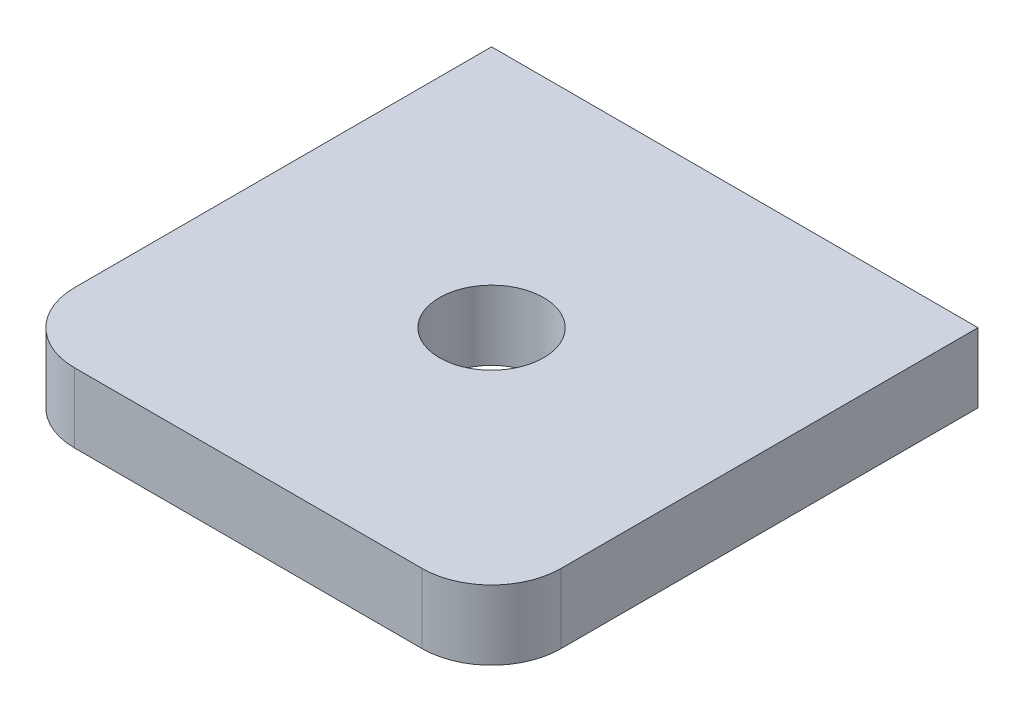
ISO-10303-21;
HEADER;
FILE_DESCRIPTION(('STEP AP214'),'2;1');
FILE_NAME('part.step','',(''),(''),'','','');
FILE_SCHEMA(('AUTOMOTIVE_DESIGN { 1 0 10303 214 1 1 1 1 }'));
ENDSEC;
DATA;
#1=APPLICATION_CONTEXT('core data for automotive mechanical design processes');
#2=APPLICATION_PROTOCOL_DEFINITION('international standard','automotive_design',2000,#1);
#3=PRODUCT_CONTEXT('',#1,'mechanical');
#4=PRODUCT('Part','Part','',(#3));
#5=PRODUCT_RELATED_PRODUCT_CATEGORY('part','',(#4));
#6=PRODUCT_DEFINITION_FORMATION('','',#4);
#7=PRODUCT_DEFINITION_CONTEXT('part definition',#1,'design');
#8=PRODUCT_DEFINITION('design','',#6,#7);
#9=PRODUCT_DEFINITION_SHAPE('','',#8);
#10=(LENGTH_UNIT() NAMED_UNIT(*) SI_UNIT(.MILLI.,.METRE.));
#11=(NAMED_UNIT(*) PLANE_ANGLE_UNIT() SI_UNIT($,.RADIAN.));
#12=(NAMED_UNIT(*) SI_UNIT($,.STERADIAN.) SOLID_ANGLE_UNIT());
#13=UNCERTAINTY_MEASURE_WITH_UNIT(LENGTH_MEASURE(1.E-05),#10,'distance_accuracy_value','');
#14=(GEOMETRIC_REPRESENTATION_CONTEXT(3) GLOBAL_UNCERTAINTY_ASSIGNED_CONTEXT((#13)) GLOBAL_UNIT_ASSIGNED_CONTEXT((#10,
#11,#12)) REPRESENTATION_CONTEXT('',''));
#15=CARTESIAN_POINT('',(0.,0.,0.));
#16=DIRECTION('',(0.,0.,1.));
#17=DIRECTION('',(1.,0.,0.));
#18=AXIS2_PLACEMENT_3D('',#15,#16,#17);
#19=CARTESIAN_POINT('',(-25.,10.,25.));
#20=DIRECTION('',(0.,-1.,0.));
#21=DIRECTION('',(0.,0.,-1.));
#22=AXIS2_PLACEMENT_3D('',#19,#20,#21);
#23=PLANE('',#22);
#24=DIRECTION('',(0.,0.,1.));
#25=VECTOR('',#24,1.);
#26=CARTESIAN_POINT('',(-35.,10.,-35.));
#27=LINE('',#26,#25);
#28=CARTESIAN_POINT('',(-35.,10.,-35.));
#29=VERTEX_POINT('',#28);
#30=CARTESIAN_POINT('',(-35.,10.,25.));
#31=VERTEX_POINT('',#30);
#32=EDGE_CURVE('E135',#29,#31,#27,.T.);
#33=ORIENTED_EDGE('',*,*,#32,.T.);
#34=CARTESIAN_POINT('',(-25.,10.,25.));
#35=DIRECTION('',(0.,1.,0.));
#36=DIRECTION('',(0.,0.,-1.));
#37=AXIS2_PLACEMENT_3D('',#34,#35,#36);
#38=CIRCLE('',#37,10.);
#39=CARTESIAN_POINT('',(-25.,10.,35.));
#40=VERTEX_POINT('',#39);
#41=EDGE_CURVE('E93',#31,#40,#38,.T.);
#42=ORIENTED_EDGE('',*,*,#41,.T.);
#43=DIRECTION('',(1.,0.,0.));
#44=VECTOR('',#43,1.);
#45=CARTESIAN_POINT('',(-25.,10.,35.));
#46=LINE('',#45,#44);
#47=CARTESIAN_POINT('',(25.,10.,35.));
#48=VERTEX_POINT('',#47);
#49=EDGE_CURVE('E106',#40,#48,#46,.T.);
#50=ORIENTED_EDGE('',*,*,#49,.T.);
#51=CARTESIAN_POINT('',(25.,10.,25.));
#52=DIRECTION('',(0.,1.,0.));
#53=DIRECTION('',(0.,0.,-1.));
#54=AXIS2_PLACEMENT_3D('',#51,#52,#53);
#55=CIRCLE('',#54,10.);
#56=CARTESIAN_POINT('',(35.,10.,25.));
#57=VERTEX_POINT('',#56);
#58=EDGE_CURVE('E100',#48,#57,#55,.T.);
#59=ORIENTED_EDGE('',*,*,#58,.T.);
#60=DIRECTION('',(0.,0.,-1.));
#61=VECTOR('',#60,1.);
#62=CARTESIAN_POINT('',(35.,10.,-35.));
#63=LINE('',#62,#61);
#64=CARTESIAN_POINT('',(35.,10.,-35.));
#65=VERTEX_POINT('',#64);
#66=EDGE_CURVE('E104',#57,#65,#63,.T.);
#67=ORIENTED_EDGE('',*,*,#66,.T.);
#68=DIRECTION('',(-1.,0.,0.));
#69=VECTOR('',#68,1.);
#70=CARTESIAN_POINT('',(-35.,10.,-35.));
#71=LINE('',#70,#69);
#72=EDGE_CURVE('E56',#65,#29,#71,.T.);
#73=ORIENTED_EDGE('',*,*,#72,.T.);
#74=EDGE_LOOP('',(#33,#42,#50,#59,#67,#73));
#75=FACE_BOUND('',#74,.T.);
#76=CARTESIAN_POINT('',(0.,10.,0.));
#77=DIRECTION('',(0.,1.,0.));
#78=DIRECTION('',(0.,0.,1.));
#79=AXIS2_PLACEMENT_3D('',#76,#77,#78);
#80=CIRCLE('',#79,7.5);
#81=CARTESIAN_POINT('',(0.,10.,7.5));
#82=VERTEX_POINT('',#81);
#83=EDGE_CURVE('E128',#82,#82,#80,.T.);
#84=ORIENTED_EDGE('',*,*,#83,.F.);
#85=EDGE_LOOP('',(#84));
#86=FACE_BOUND('',#85,.T.);
#87=ADVANCED_FACE('F39',(#75,#86),#23,.F.);
#88=CARTESIAN_POINT('',(-25.,0.,25.));
#89=DIRECTION('',(0.,-1.,0.));
#90=DIRECTION('',(0.,0.,-1.));
#91=AXIS2_PLACEMENT_3D('',#88,#89,#90);
#92=PLANE('',#91);
#93=DIRECTION('',(0.,0.,1.));
#94=VECTOR('',#93,1.);
#95=CARTESIAN_POINT('',(-35.,0.,-35.));
#96=LINE('',#95,#94);
#97=CARTESIAN_POINT('',(-35.,0.,-35.));
#98=VERTEX_POINT('',#97);
#99=CARTESIAN_POINT('',(-35.,0.,25.));
#100=VERTEX_POINT('',#99);
#101=EDGE_CURVE('E124',#98,#100,#96,.T.);
#102=ORIENTED_EDGE('',*,*,#101,.F.);
#103=DIRECTION('',(-1.,0.,0.));
#104=VECTOR('',#103,1.);
#105=CARTESIAN_POINT('',(-35.,0.,-35.));
#106=LINE('',#105,#104);
#107=CARTESIAN_POINT('',(35.,0.,-35.));
#108=VERTEX_POINT('',#107);
#109=EDGE_CURVE('E85',#108,#98,#106,.T.);
#110=ORIENTED_EDGE('',*,*,#109,.F.);
#111=DIRECTION('',(0.,0.,-1.));
#112=VECTOR('',#111,1.);
#113=CARTESIAN_POINT('',(35.,0.,-35.));
#114=LINE('',#113,#112);
#115=CARTESIAN_POINT('',(35.,0.,25.));
#116=VERTEX_POINT('',#115);
#117=EDGE_CURVE('E79',#116,#108,#114,.T.);
#118=ORIENTED_EDGE('',*,*,#117,.F.);
#119=CARTESIAN_POINT('',(25.,0.,25.));
#120=DIRECTION('',(0.,1.,0.));
#121=DIRECTION('',(0.,0.,-1.));
#122=AXIS2_PLACEMENT_3D('',#119,#120,#121);
#123=CIRCLE('',#122,10.);
#124=CARTESIAN_POINT('',(25.,0.,35.));
#125=VERTEX_POINT('',#124);
#126=EDGE_CURVE('E114',#125,#116,#123,.T.);
#127=ORIENTED_EDGE('',*,*,#126,.F.);
#128=DIRECTION('',(1.,0.,0.));
#129=VECTOR('',#128,1.);
#130=CARTESIAN_POINT('',(-25.,0.,35.));
#131=LINE('',#130,#129);
#132=CARTESIAN_POINT('',(-25.,0.,35.));
#133=VERTEX_POINT('',#132);
#134=EDGE_CURVE('E130',#133,#125,#131,.T.);
#135=ORIENTED_EDGE('',*,*,#134,.F.);
#136=CARTESIAN_POINT('',(-25.,0.,25.));
#137=DIRECTION('',(0.,1.,0.));
#138=DIRECTION('',(0.,0.,-1.));
#139=AXIS2_PLACEMENT_3D('',#136,#137,#138);
#140=CIRCLE('',#139,10.);
#141=EDGE_CURVE('E127',#100,#133,#140,.T.);
#142=ORIENTED_EDGE('',*,*,#141,.F.);
#143=EDGE_LOOP('',(#102,#110,#118,#127,#135,#142));
#144=FACE_BOUND('',#143,.T.);
#145=CARTESIAN_POINT('',(0.,0.,0.));
#146=DIRECTION('',(0.,1.,0.));
#147=DIRECTION('',(0.,0.,1.));
#148=AXIS2_PLACEMENT_3D('',#145,#146,#147);
#149=CIRCLE('',#148,7.5);
#150=CARTESIAN_POINT('',(0.,0.,7.5));
#151=VERTEX_POINT('',#150);
#152=EDGE_CURVE('E228',#151,#151,#149,.T.);
#153=ORIENTED_EDGE('',*,*,#152,.T.);
#154=EDGE_LOOP('',(#153));
#155=FACE_BOUND('',#154,.T.);
#156=ADVANCED_FACE('F144',(#144,#155),#92,.T.);
#157=CARTESIAN_POINT('',(-35.,10.,-35.));
#158=DIRECTION('',(1.,0.,0.));
#159=DIRECTION('',(0.,0.,-1.));
#160=AXIS2_PLACEMENT_3D('',#157,#158,#159);
#161=PLANE('',#160);
#162=ORIENTED_EDGE('',*,*,#101,.T.);
#163=DIRECTION('',(0.,-1.,0.));
#164=VECTOR('',#163,1.);
#165=CARTESIAN_POINT('',(-35.,10.,25.));
#166=LINE('',#165,#164);
#167=EDGE_CURVE('E11',#31,#100,#166,.T.);
#168=ORIENTED_EDGE('',*,*,#167,.F.);
#169=ORIENTED_EDGE('',*,*,#32,.F.);
#170=DIRECTION('',(0.,-1.,0.));
#171=VECTOR('',#170,1.);
#172=CARTESIAN_POINT('',(-35.,10.,-35.));
#173=LINE('',#172,#171);
#174=EDGE_CURVE('E120',#29,#98,#173,.T.);
#175=ORIENTED_EDGE('',*,*,#174,.T.);
#176=EDGE_LOOP('',(#162,#168,#169,#175));
#177=FACE_BOUND('',#176,.T.);
#178=ADVANCED_FACE('F41',(#177),#161,.F.);
#179=CARTESIAN_POINT('',(-25.,10.,25.));
#180=DIRECTION('',(0.,-1.,0.));
#181=DIRECTION('',(0.,0.,-1.));
#182=AXIS2_PLACEMENT_3D('',#179,#180,#181);
#183=CYLINDRICAL_SURFACE('',#182,10.);
#184=ORIENTED_EDGE('',*,*,#141,.T.);
#185=DIRECTION('',(0.,-1.,0.));
#186=VECTOR('',#185,1.);
#187=CARTESIAN_POINT('',(-25.,10.,35.));
#188=LINE('',#187,#186);
#189=EDGE_CURVE('E48',#40,#133,#188,.T.);
#190=ORIENTED_EDGE('',*,*,#189,.F.);
#191=ORIENTED_EDGE('',*,*,#41,.F.);
#192=ORIENTED_EDGE('',*,*,#167,.T.);
#193=EDGE_LOOP('',(#184,#190,#191,#192));
#194=FACE_BOUND('',#193,.T.);
#195=ADVANCED_FACE('F169',(#194),#183,.T.);
#196=CARTESIAN_POINT('',(-25.,10.,35.));
#197=DIRECTION('',(0.,0.,-1.));
#198=DIRECTION('',(-1.,0.,0.));
#199=AXIS2_PLACEMENT_3D('',#196,#197,#198);
#200=PLANE('',#199);
#201=ORIENTED_EDGE('',*,*,#134,.T.);
#202=DIRECTION('',(0.,-1.,0.));
#203=VECTOR('',#202,1.);
#204=CARTESIAN_POINT('',(25.,10.,35.));
#205=LINE('',#204,#203);
#206=EDGE_CURVE('E115',#48,#125,#205,.T.);
#207=ORIENTED_EDGE('',*,*,#206,.F.);
#208=ORIENTED_EDGE('',*,*,#49,.F.);
#209=ORIENTED_EDGE('',*,*,#189,.T.);
#210=EDGE_LOOP('',(#201,#207,#208,#209));
#211=FACE_BOUND('',#210,.T.);
#212=ADVANCED_FACE('F141',(#211),#200,.F.);
#213=CARTESIAN_POINT('',(25.,10.,25.));
#214=DIRECTION('',(0.,-1.,0.));
#215=DIRECTION('',(0.,0.,-1.));
#216=AXIS2_PLACEMENT_3D('',#213,#214,#215);
#217=CYLINDRICAL_SURFACE('',#216,10.);
#218=ORIENTED_EDGE('',*,*,#126,.T.);
#219=DIRECTION('',(0.,-1.,0.));
#220=VECTOR('',#219,1.);
#221=CARTESIAN_POINT('',(35.,10.,25.));
#222=LINE('',#221,#220);
#223=EDGE_CURVE('E111',#57,#116,#222,.T.);
#224=ORIENTED_EDGE('',*,*,#223,.F.);
#225=ORIENTED_EDGE('',*,*,#58,.F.);
#226=ORIENTED_EDGE('',*,*,#206,.T.);
#227=EDGE_LOOP('',(#218,#224,#225,#226));
#228=FACE_BOUND('',#227,.T.);
#229=ADVANCED_FACE('F112',(#228),#217,.T.);
#230=CARTESIAN_POINT('',(35.,10.,-35.));
#231=DIRECTION('',(-1.,0.,0.));
#232=DIRECTION('',(0.,0.,1.));
#233=AXIS2_PLACEMENT_3D('',#230,#231,#232);
#234=PLANE('',#233);
#235=ORIENTED_EDGE('',*,*,#117,.T.);
#236=DIRECTION('',(0.,-1.,0.));
#237=VECTOR('',#236,1.);
#238=CARTESIAN_POINT('',(35.,10.,-35.));
#239=LINE('',#238,#237);
#240=EDGE_CURVE('E116',#65,#108,#239,.T.);
#241=ORIENTED_EDGE('',*,*,#240,.F.);
#242=ORIENTED_EDGE('',*,*,#66,.F.);
#243=ORIENTED_EDGE('',*,*,#223,.T.);
#244=EDGE_LOOP('',(#235,#241,#242,#243));
#245=FACE_BOUND('',#244,.T.);
#246=ADVANCED_FACE('F118',(#245),#234,.F.);
#247=CARTESIAN_POINT('',(-35.,10.,-35.));
#248=DIRECTION('',(0.,0.,1.));
#249=DIRECTION('',(1.,0.,0.));
#250=AXIS2_PLACEMENT_3D('',#247,#248,#249);
#251=PLANE('',#250);
#252=ORIENTED_EDGE('',*,*,#109,.T.);
#253=ORIENTED_EDGE('',*,*,#174,.F.);
#254=ORIENTED_EDGE('',*,*,#72,.F.);
#255=ORIENTED_EDGE('',*,*,#240,.T.);
#256=EDGE_LOOP('',(#252,#253,#254,#255));
#257=FACE_BOUND('',#256,.T.);
#258=ADVANCED_FACE('F149',(#257),#251,.F.);
#259=CARTESIAN_POINT('',(0.,10.,0.));
#260=DIRECTION('',(0.,-1.,0.));
#261=DIRECTION('',(0.,0.,-1.));
#262=AXIS2_PLACEMENT_3D('',#259,#260,#261);
#263=CYLINDRICAL_SURFACE('',#262,7.5);
#264=ORIENTED_EDGE('',*,*,#83,.T.);
#265=EDGE_LOOP('',(#264));
#266=FACE_BOUND('',#265,.T.);
#267=ORIENTED_EDGE('',*,*,#152,.F.);
#268=EDGE_LOOP('',(#267));
#269=FACE_BOUND('',#268,.T.);
#270=ADVANCED_FACE('F151',(#266,#269),#263,.F.);
#271=CLOSED_SHELL('',(#87,#156,#178,#195,#212,#229,#246,#258,#270));
#272=MANIFOLD_SOLID_BREP('B2',#271);
#273=ADVANCED_BREP_SHAPE_REPRESENTATION('',(#18,#272),#14);
#274=SHAPE_DEFINITION_REPRESENTATION(#9,#273);
ENDSEC;
END-ISO-10303-21;
